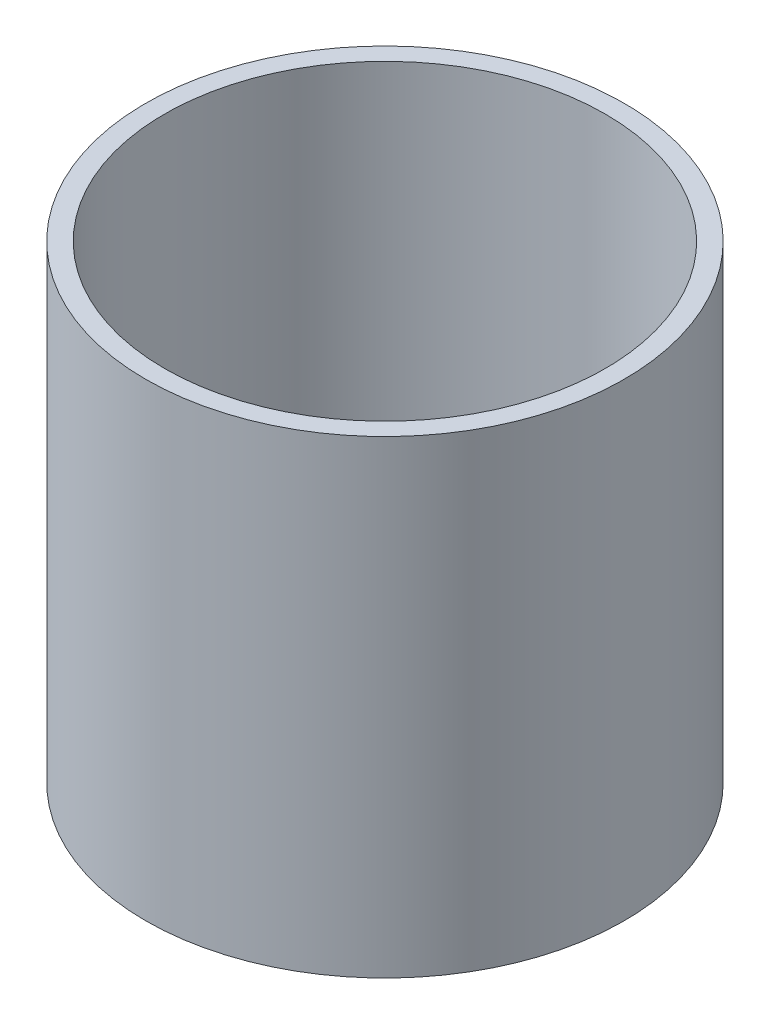
ISO-10303-21;
HEADER;
FILE_DESCRIPTION(('STEP AP214'),'2;1');
FILE_NAME('part.step','',(''),(''),'','','');
FILE_SCHEMA(('AUTOMOTIVE_DESIGN { 1 0 10303 214 1 1 1 1 }'));
ENDSEC;
DATA;
#1=APPLICATION_CONTEXT('core data for automotive mechanical design processes');
#2=APPLICATION_PROTOCOL_DEFINITION('international standard','automotive_design',2000,#1);
#3=PRODUCT_CONTEXT('',#1,'mechanical');
#4=PRODUCT('Part','Part','',(#3));
#5=PRODUCT_RELATED_PRODUCT_CATEGORY('part','',(#4));
#6=PRODUCT_DEFINITION_FORMATION('','',#4);
#7=PRODUCT_DEFINITION_CONTEXT('part definition',#1,'design');
#8=PRODUCT_DEFINITION('design','',#6,#7);
#9=PRODUCT_DEFINITION_SHAPE('','',#8);
#10=(LENGTH_UNIT() NAMED_UNIT(*) SI_UNIT(.MILLI.,.METRE.));
#11=(NAMED_UNIT(*) PLANE_ANGLE_UNIT() SI_UNIT($,.RADIAN.));
#12=(NAMED_UNIT(*) SI_UNIT($,.STERADIAN.) SOLID_ANGLE_UNIT());
#13=UNCERTAINTY_MEASURE_WITH_UNIT(LENGTH_MEASURE(1.E-05),#10,'distance_accuracy_value','');
#14=(GEOMETRIC_REPRESENTATION_CONTEXT(3) GLOBAL_UNCERTAINTY_ASSIGNED_CONTEXT((#13)) GLOBAL_UNIT_ASSIGNED_CONTEXT((#10,
#11,#12)) REPRESENTATION_CONTEXT('',''));
#15=CARTESIAN_POINT('',(0.,0.,0.));
#16=DIRECTION('',(0.,0.,1.));
#17=DIRECTION('',(1.,0.,0.));
#18=AXIS2_PLACEMENT_3D('',#15,#16,#17);
#19=CARTESIAN_POINT('',(0.,50.,0.));
#20=DIRECTION('',(0.,1.,0.));
#21=DIRECTION('',(0.,0.,1.));
#22=AXIS2_PLACEMENT_3D('',#19,#20,#21);
#23=PLANE('',#22);
#24=CARTESIAN_POINT('',(0.,50.,0.));
#25=DIRECTION('',(0.,1.,0.));
#26=DIRECTION('',(0.,0.,1.));
#27=AXIS2_PLACEMENT_3D('',#24,#25,#26);
#28=CIRCLE('',#27,25.5);
#29=CARTESIAN_POINT('',(0.,50.,25.5));
#30=VERTEX_POINT('',#29);
#31=EDGE_CURVE('E10',#30,#30,#28,.T.);
#32=ORIENTED_EDGE('',*,*,#31,.T.);
#33=EDGE_LOOP('',(#32));
#34=FACE_BOUND('',#33,.T.);
#35=CARTESIAN_POINT('',(0.,50.,0.));
#36=DIRECTION('',(0.,1.,0.));
#37=DIRECTION('',(0.,0.,1.));
#38=AXIS2_PLACEMENT_3D('',#35,#36,#37);
#39=CIRCLE('',#38,23.5);
#40=CARTESIAN_POINT('',(0.,50.,23.5));
#41=VERTEX_POINT('',#40);
#42=EDGE_CURVE('E46',#41,#41,#39,.T.);
#43=ORIENTED_EDGE('',*,*,#42,.F.);
#44=EDGE_LOOP('',(#43));
#45=FACE_BOUND('',#44,.T.);
#46=ADVANCED_FACE('F35',(#34,#45),#23,.T.);
#47=CARTESIAN_POINT('',(0.,0.,0.));
#48=DIRECTION('',(0.,1.,0.));
#49=DIRECTION('',(0.,0.,1.));
#50=AXIS2_PLACEMENT_3D('',#47,#48,#49);
#51=PLANE('',#50);
#52=CARTESIAN_POINT('',(0.,0.,0.));
#53=DIRECTION('',(0.,1.,0.));
#54=DIRECTION('',(0.,0.,1.));
#55=AXIS2_PLACEMENT_3D('',#52,#53,#54);
#56=CIRCLE('',#55,25.5);
#57=CARTESIAN_POINT('',(0.,0.,25.5));
#58=VERTEX_POINT('',#57);
#59=EDGE_CURVE('E39',#58,#58,#56,.T.);
#60=ORIENTED_EDGE('',*,*,#59,.F.);
#61=EDGE_LOOP('',(#60));
#62=FACE_BOUND('',#61,.T.);
#63=CARTESIAN_POINT('',(0.,0.,0.));
#64=DIRECTION('',(0.,1.,0.));
#65=DIRECTION('',(0.,0.,1.));
#66=AXIS2_PLACEMENT_3D('',#63,#64,#65);
#67=CIRCLE('',#66,23.5);
#68=CARTESIAN_POINT('',(0.,0.,23.5));
#69=VERTEX_POINT('',#68);
#70=EDGE_CURVE('E48',#69,#69,#67,.T.);
#71=ORIENTED_EDGE('',*,*,#70,.T.);
#72=EDGE_LOOP('',(#71));
#73=FACE_BOUND('',#72,.T.);
#74=ADVANCED_FACE('F58',(#62,#73),#51,.F.);
#75=CARTESIAN_POINT('',(0.,50.,0.));
#76=DIRECTION('',(0.,-1.,0.));
#77=DIRECTION('',(0.,0.,-1.));
#78=AXIS2_PLACEMENT_3D('',#75,#76,#77);
#79=CYLINDRICAL_SURFACE('',#78,25.5);
#80=ORIENTED_EDGE('',*,*,#31,.F.);
#81=EDGE_LOOP('',(#80));
#82=FACE_BOUND('',#81,.T.);
#83=ORIENTED_EDGE('',*,*,#59,.T.);
#84=EDGE_LOOP('',(#83));
#85=FACE_BOUND('',#84,.T.);
#86=ADVANCED_FACE('F37',(#82,#85),#79,.T.);
#87=CARTESIAN_POINT('',(0.,50.,0.));
#88=DIRECTION('',(0.,-1.,0.));
#89=DIRECTION('',(0.,0.,-1.));
#90=AXIS2_PLACEMENT_3D('',#87,#88,#89);
#91=CYLINDRICAL_SURFACE('',#90,23.5);
#92=ORIENTED_EDGE('',*,*,#42,.T.);
#93=EDGE_LOOP('',(#92));
#94=FACE_BOUND('',#93,.T.);
#95=ORIENTED_EDGE('',*,*,#70,.F.);
#96=EDGE_LOOP('',(#95));
#97=FACE_BOUND('',#96,.T.);
#98=ADVANCED_FACE('F54',(#94,#97),#91,.F.);
#99=CLOSED_SHELL('',(#46,#74,#86,#98));
#100=MANIFOLD_SOLID_BREP('B2',#99);
#101=ADVANCED_BREP_SHAPE_REPRESENTATION('',(#18,#100),#14);
#102=SHAPE_DEFINITION_REPRESENTATION(#9,#101);
ENDSEC;
END-ISO-10303-21;
